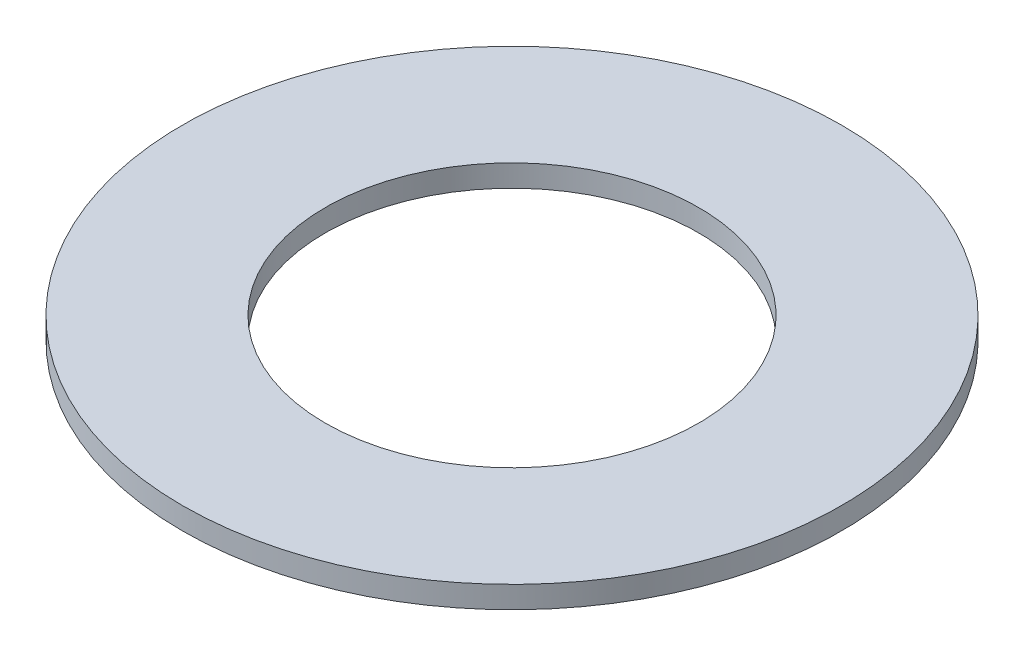
ISO-10303-21;
HEADER;
FILE_DESCRIPTION(('STEP AP214'),'2;1');
FILE_NAME('part.step','',(''),(''),'','','');
FILE_SCHEMA(('AUTOMOTIVE_DESIGN { 1 0 10303 214 1 1 1 1 }'));
ENDSEC;
DATA;
#1=APPLICATION_CONTEXT('core data for automotive mechanical design processes');
#2=APPLICATION_PROTOCOL_DEFINITION('international standard','automotive_design',2000,#1);
#3=PRODUCT_CONTEXT('',#1,'mechanical');
#4=PRODUCT('Part','Part','',(#3));
#5=PRODUCT_RELATED_PRODUCT_CATEGORY('part','',(#4));
#6=PRODUCT_DEFINITION_FORMATION('','',#4);
#7=PRODUCT_DEFINITION_CONTEXT('part definition',#1,'design');
#8=PRODUCT_DEFINITION('design','',#6,#7);
#9=PRODUCT_DEFINITION_SHAPE('','',#8);
#10=(LENGTH_UNIT() NAMED_UNIT(*) SI_UNIT(.MILLI.,.METRE.));
#11=(NAMED_UNIT(*) PLANE_ANGLE_UNIT() SI_UNIT($,.RADIAN.));
#12=(NAMED_UNIT(*) SI_UNIT($,.STERADIAN.) SOLID_ANGLE_UNIT());
#13=UNCERTAINTY_MEASURE_WITH_UNIT(LENGTH_MEASURE(1.E-05),#10,'distance_accuracy_value','');
#14=(GEOMETRIC_REPRESENTATION_CONTEXT(3) GLOBAL_UNCERTAINTY_ASSIGNED_CONTEXT((#13)) GLOBAL_UNIT_ASSIGNED_CONTEXT((#10,
#11,#12)) REPRESENTATION_CONTEXT('',''));
#15=CARTESIAN_POINT('',(0.,0.,0.));
#16=DIRECTION('',(0.,0.,1.));
#17=DIRECTION('',(1.,0.,0.));
#18=AXIS2_PLACEMENT_3D('',#15,#16,#17);
#19=CARTESIAN_POINT('',(0.,5.,0.));
#20=DIRECTION('',(0.,-1.,0.));
#21=DIRECTION('',(0.,0.,-1.));
#22=AXIS2_PLACEMENT_3D('',#19,#20,#21);
#23=CYLINDRICAL_SURFACE('',#22,75.);
#24=CARTESIAN_POINT('',(0.,5.,0.));
#25=DIRECTION('',(0.,1.,0.));
#26=DIRECTION('',(0.,0.,1.));
#27=AXIS2_PLACEMENT_3D('',#24,#25,#26);
#28=CIRCLE('',#27,75.);
#29=CARTESIAN_POINT('',(0.,5.,75.));
#30=VERTEX_POINT('',#29);
#31=EDGE_CURVE('E10',#30,#30,#28,.T.);
#32=ORIENTED_EDGE('',*,*,#31,.F.);
#33=EDGE_LOOP('',(#32));
#34=FACE_BOUND('',#33,.T.);
#35=CARTESIAN_POINT('',(0.,0.,0.));
#36=DIRECTION('',(0.,1.,0.));
#37=DIRECTION('',(0.,0.,1.));
#38=AXIS2_PLACEMENT_3D('',#35,#36,#37);
#39=CIRCLE('',#38,75.);
#40=CARTESIAN_POINT('',(0.,0.,75.));
#41=VERTEX_POINT('',#40);
#42=EDGE_CURVE('E37',#41,#41,#39,.T.);
#43=ORIENTED_EDGE('',*,*,#42,.T.);
#44=EDGE_LOOP('',(#43));
#45=FACE_BOUND('',#44,.T.);
#46=ADVANCED_FACE('F40',(#34,#45),#23,.T.);
#47=CARTESIAN_POINT('',(0.,5.,0.));
#48=DIRECTION('',(0.,1.,0.));
#49=DIRECTION('',(0.,0.,1.));
#50=AXIS2_PLACEMENT_3D('',#47,#48,#49);
#51=PLANE('',#50);
#52=CARTESIAN_POINT('',(0.,5.,0.));
#53=DIRECTION('',(0.,1.,0.));
#54=DIRECTION('',(0.,0.,1.));
#55=AXIS2_PLACEMENT_3D('',#52,#53,#54);
#56=CIRCLE('',#55,42.5);
#57=CARTESIAN_POINT('',(0.,5.,42.5));
#58=VERTEX_POINT('',#57);
#59=EDGE_CURVE('E50',#58,#58,#56,.T.);
#60=ORIENTED_EDGE('',*,*,#59,.F.);
#61=EDGE_LOOP('',(#60));
#62=FACE_BOUND('',#61,.T.);
#63=ORIENTED_EDGE('',*,*,#31,.T.);
#64=EDGE_LOOP('',(#63));
#65=FACE_BOUND('',#64,.T.);
#66=ADVANCED_FACE('F59',(#62,#65),#51,.T.);
#67=CARTESIAN_POINT('',(0.,0.,0.));
#68=DIRECTION('',(0.,1.,0.));
#69=DIRECTION('',(0.,0.,1.));
#70=AXIS2_PLACEMENT_3D('',#67,#68,#69);
#71=PLANE('',#70);
#72=CARTESIAN_POINT('',(0.,0.,0.));
#73=DIRECTION('',(0.,1.,0.));
#74=DIRECTION('',(0.,0.,1.));
#75=AXIS2_PLACEMENT_3D('',#72,#73,#74);
#76=CIRCLE('',#75,42.5);
#77=CARTESIAN_POINT('',(0.,0.,42.5));
#78=VERTEX_POINT('',#77);
#79=EDGE_CURVE('E47',#78,#78,#76,.T.);
#80=ORIENTED_EDGE('',*,*,#79,.T.);
#81=EDGE_LOOP('',(#80));
#82=FACE_BOUND('',#81,.T.);
#83=ORIENTED_EDGE('',*,*,#42,.F.);
#84=EDGE_LOOP('',(#83));
#85=FACE_BOUND('',#84,.T.);
#86=ADVANCED_FACE('F58',(#82,#85),#71,.F.);
#87=CARTESIAN_POINT('',(0.,5.,0.));
#88=DIRECTION('',(0.,-1.,0.));
#89=DIRECTION('',(0.,0.,-1.));
#90=AXIS2_PLACEMENT_3D('',#87,#88,#89);
#91=CYLINDRICAL_SURFACE('',#90,42.5);
#92=ORIENTED_EDGE('',*,*,#59,.T.);
#93=EDGE_LOOP('',(#92));
#94=FACE_BOUND('',#93,.T.);
#95=ORIENTED_EDGE('',*,*,#79,.F.);
#96=EDGE_LOOP('',(#95));
#97=FACE_BOUND('',#96,.T.);
#98=ADVANCED_FACE('F54',(#94,#97),#91,.F.);
#99=CLOSED_SHELL('',(#46,#66,#86,#98));
#100=MANIFOLD_SOLID_BREP('B2',#99);
#101=ADVANCED_BREP_SHAPE_REPRESENTATION('',(#18,#100),#14);
#102=SHAPE_DEFINITION_REPRESENTATION(#9,#101);
ENDSEC;
END-ISO-10303-21;
